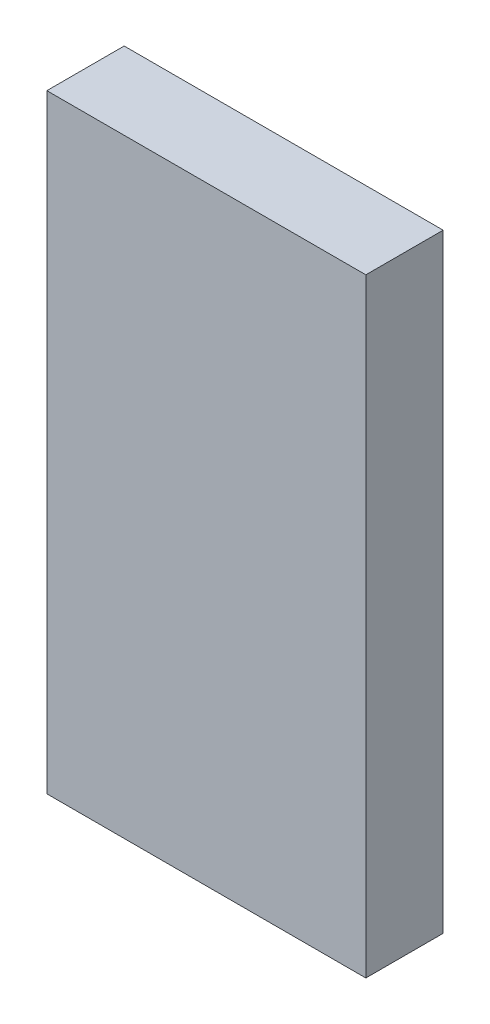
ISO-10303-21;
HEADER;
FILE_DESCRIPTION(('STEP AP214'),'2;1');
FILE_NAME('part.step','',(''),(''),'','','');
FILE_SCHEMA(('AUTOMOTIVE_DESIGN { 1 0 10303 214 1 1 1 1 }'));
ENDSEC;
DATA;
#1=APPLICATION_CONTEXT('core data for automotive mechanical design processes');
#2=APPLICATION_PROTOCOL_DEFINITION('international standard','automotive_design',2000,#1);
#3=PRODUCT_CONTEXT('',#1,'mechanical');
#4=PRODUCT('Part','Part','',(#3));
#5=PRODUCT_RELATED_PRODUCT_CATEGORY('part','',(#4));
#6=PRODUCT_DEFINITION_FORMATION('','',#4);
#7=PRODUCT_DEFINITION_CONTEXT('part definition',#1,'design');
#8=PRODUCT_DEFINITION('design','',#6,#7);
#9=PRODUCT_DEFINITION_SHAPE('','',#8);
#10=(LENGTH_UNIT() NAMED_UNIT(*) SI_UNIT(.MILLI.,.METRE.));
#11=(NAMED_UNIT(*) PLANE_ANGLE_UNIT() SI_UNIT($,.RADIAN.));
#12=(NAMED_UNIT(*) SI_UNIT($,.STERADIAN.) SOLID_ANGLE_UNIT());
#13=UNCERTAINTY_MEASURE_WITH_UNIT(LENGTH_MEASURE(1.E-05),#10,'distance_accuracy_value','');
#14=(GEOMETRIC_REPRESENTATION_CONTEXT(3) GLOBAL_UNCERTAINTY_ASSIGNED_CONTEXT((#13)) GLOBAL_UNIT_ASSIGNED_CONTEXT((#10,
#11,#12)) REPRESENTATION_CONTEXT('',''));
#15=CARTESIAN_POINT('',(0.,0.,0.));
#16=DIRECTION('',(0.,0.,1.));
#17=DIRECTION('',(1.,0.,0.));
#18=AXIS2_PLACEMENT_3D('',#15,#16,#17);
#19=CARTESIAN_POINT('',(17.9471960328776,-13.8940277297927,1.03674100901396E-06));
#20=DIRECTION('',(0.,8.74227339409095E-08,-1.));
#21=DIRECTION('',(1.19248806384999E-08,1.,8.74227339409095E-08));
#22=AXIS2_PLACEMENT_3D('',#19,#20,#21);
#23=PLANE('',#22);
#24=DIRECTION('',(-1.19248807761764E-08,-1.,-8.74227339409095E-08));
#25=VECTOR('',#24,1.);
#26=CARTESIAN_POINT('',(16.2971960328777,-13.8940277101167,1.03674101074869E-06));
#27=LINE('',#26,#25);
#28=CARTESIAN_POINT('',(16.297196070441,-10.7440277101167,1.3121226227937E-06));
#29=VERTEX_POINT('',#28);
#30=CARTESIAN_POINT('',(16.2971959953143,-17.0440277101166,7.61359398703671E-07));
#31=VERTEX_POINT('',#30);
#32=EDGE_CURVE('E90',#29,#31,#27,.T.);
#33=ORIENTED_EDGE('',*,*,#32,.T.);
#34=DIRECTION('',(1.,-1.19248806384999E-08,0.));
#35=VECTOR('',#34,1.);
#36=CARTESIAN_POINT('',(17.9471959953143,-17.0440277297927,7.61359396968947E-07));
#37=LINE('',#36,#35);
#38=CARTESIAN_POINT('',(19.5971959953143,-17.0440277494687,7.61359395234224E-07));
#39=VERTEX_POINT('',#38);
#40=EDGE_CURVE('E27',#31,#39,#37,.T.);
#41=ORIENTED_EDGE('',*,*,#40,.T.);
#42=DIRECTION('',(-1.19248807761764E-08,-1.,-8.74227339409095E-08));
#43=VECTOR('',#42,1.);
#44=CARTESIAN_POINT('',(19.5971960328776,-13.8940277494688,1.03674100727924E-06));
#45=LINE('',#44,#43);
#46=CARTESIAN_POINT('',(19.5971960704411,-10.7440277494688,1.31212261932426E-06));
#47=VERTEX_POINT('',#46);
#48=EDGE_CURVE('E78',#47,#39,#45,.T.);
#49=ORIENTED_EDGE('',*,*,#48,.F.);
#50=DIRECTION('',(1.,-1.19248806384999E-08,0.));
#51=VECTOR('',#50,1.);
#52=CARTESIAN_POINT('',(17.9471960704411,-10.7440277297927,1.31212262105898E-06));
#53=LINE('',#52,#51);
#54=EDGE_CURVE('E101',#29,#47,#53,.T.);
#55=ORIENTED_EDGE('',*,*,#54,.F.);
#56=EDGE_LOOP('',(#33,#41,#49,#55));
#57=FACE_BOUND('',#56,.T.);
#58=ADVANCED_FACE('F17',(#57),#23,.F.);
#59=CARTESIAN_POINT('',(17.9471960328776,-13.8940276598545,-0.799998963258989));
#60=DIRECTION('',(0.,8.74227339409095E-08,-1.));
#61=DIRECTION('',(1.19248806384999E-08,1.,8.74227339409095E-08));
#62=AXIS2_PLACEMENT_3D('',#59,#60,#61);
#63=PLANE('',#62);
#64=DIRECTION('',(-1.19248807761764E-08,-1.,-8.74227339409095E-08));
#65=VECTOR('',#64,1.);
#66=CARTESIAN_POINT('',(16.2971960328777,-13.8940276401785,-0.799998963258987));
#67=LINE('',#66,#65);
#68=CARTESIAN_POINT('',(16.297196070441,-10.7440276401785,-0.799998687877375));
#69=VERTEX_POINT('',#68);
#70=CARTESIAN_POINT('',(16.2971959953143,-17.0440276401785,-0.799999238640599));
#71=VERTEX_POINT('',#70);
#72=EDGE_CURVE('E81',#69,#71,#67,.T.);
#73=ORIENTED_EDGE('',*,*,#72,.F.);
#74=DIRECTION('',(1.,-1.19248806384999E-08,0.));
#75=VECTOR('',#74,1.);
#76=CARTESIAN_POINT('',(17.9471960704411,-10.7440276598545,-0.799998687877377));
#77=LINE('',#76,#75);
#78=CARTESIAN_POINT('',(19.5971960704411,-10.7440276795306,-0.799998687877378));
#79=VERTEX_POINT('',#78);
#80=EDGE_CURVE('E67',#69,#79,#77,.T.);
#81=ORIENTED_EDGE('',*,*,#80,.T.);
#82=DIRECTION('',(-1.19248807761764E-08,-1.,-8.74227339409095E-08));
#83=VECTOR('',#82,1.);
#84=CARTESIAN_POINT('',(19.5971960328776,-13.8940276795306,-0.799998963258991));
#85=LINE('',#84,#83);
#86=CARTESIAN_POINT('',(19.5971959953143,-17.0440276795306,-0.799999238640603));
#87=VERTEX_POINT('',#86);
#88=EDGE_CURVE('E111',#79,#87,#85,.T.);
#89=ORIENTED_EDGE('',*,*,#88,.T.);
#90=DIRECTION('',(1.,-1.19248806384999E-08,0.));
#91=VECTOR('',#90,1.);
#92=CARTESIAN_POINT('',(17.9471959953143,-17.0440276598545,-0.799999238640601));
#93=LINE('',#92,#91);
#94=EDGE_CURVE('E11',#71,#87,#93,.T.);
#95=ORIENTED_EDGE('',*,*,#94,.F.);
#96=EDGE_LOOP('',(#73,#81,#89,#95));
#97=FACE_BOUND('',#96,.T.);
#98=ADVANCED_FACE('F82',(#97),#63,.T.);
#99=CARTESIAN_POINT('',(17.9471959953143,-17.0440276598545,-0.799999238640601));
#100=DIRECTION('',(-1.19248806384999E-08,-1.,-8.74227339409095E-08));
#101=DIRECTION('',(0.,8.74227339409095E-08,-1.));
#102=AXIS2_PLACEMENT_3D('',#99,#100,#101);
#103=PLANE('',#102);
#104=ORIENTED_EDGE('',*,*,#40,.F.);
#105=DIRECTION('',(0.,-8.74227339409095E-08,1.));
#106=VECTOR('',#105,1.);
#107=CARTESIAN_POINT('',(16.2971959953143,-17.0440276401785,-0.799999238640599));
#108=LINE('',#107,#106);
#109=EDGE_CURVE('E86',#71,#31,#108,.T.);
#110=ORIENTED_EDGE('',*,*,#109,.F.);
#111=ORIENTED_EDGE('',*,*,#94,.T.);
#112=DIRECTION('',(0.,-8.74227339409095E-08,1.));
#113=VECTOR('',#112,1.);
#114=CARTESIAN_POINT('',(19.5971959953143,-17.0440276795306,-0.799999238640603));
#115=LINE('',#114,#113);
#116=EDGE_CURVE('E108',#87,#39,#115,.T.);
#117=ORIENTED_EDGE('',*,*,#116,.T.);
#118=EDGE_LOOP('',(#104,#110,#111,#117));
#119=FACE_BOUND('',#118,.T.);
#120=ADVANCED_FACE('F140',(#119),#103,.T.);
#121=CARTESIAN_POINT('',(19.5971960328776,-13.8940276795306,-0.799998963258991));
#122=DIRECTION('',(-1.,1.19248807761763E-08,0.));
#123=DIRECTION('',(1.19248807761764E-08,1.,8.74227339409095E-08));
#124=AXIS2_PLACEMENT_3D('',#121,#122,#123);
#125=PLANE('',#124);
#126=ORIENTED_EDGE('',*,*,#48,.T.);
#127=ORIENTED_EDGE('',*,*,#116,.F.);
#128=ORIENTED_EDGE('',*,*,#88,.F.);
#129=DIRECTION('',(0.,-8.74227339409095E-08,1.));
#130=VECTOR('',#129,1.);
#131=CARTESIAN_POINT('',(19.5971960704411,-10.7440276795306,-0.799998687877378));
#132=LINE('',#131,#130);
#133=EDGE_CURVE('E75',#79,#47,#132,.T.);
#134=ORIENTED_EDGE('',*,*,#133,.T.);
#135=EDGE_LOOP('',(#126,#127,#128,#134));
#136=FACE_BOUND('',#135,.T.);
#137=ADVANCED_FACE('F139',(#136),#125,.F.);
#138=CARTESIAN_POINT('',(17.9471960704411,-10.7440276598545,-0.799998687877377));
#139=DIRECTION('',(-1.19248806384999E-08,-1.,-8.74227339409095E-08));
#140=DIRECTION('',(0.,8.74227339409095E-08,-1.));
#141=AXIS2_PLACEMENT_3D('',#138,#139,#140);
#142=PLANE('',#141);
#143=ORIENTED_EDGE('',*,*,#54,.T.);
#144=ORIENTED_EDGE('',*,*,#133,.F.);
#145=ORIENTED_EDGE('',*,*,#80,.F.);
#146=DIRECTION('',(0.,-8.74227339409095E-08,1.));
#147=VECTOR('',#146,1.);
#148=CARTESIAN_POINT('',(16.297196070441,-10.7440276401785,-0.799998687877375));
#149=LINE('',#148,#147);
#150=EDGE_CURVE('E72',#69,#29,#149,.T.);
#151=ORIENTED_EDGE('',*,*,#150,.T.);
#152=EDGE_LOOP('',(#143,#144,#145,#151));
#153=FACE_BOUND('',#152,.T.);
#154=ADVANCED_FACE('F70',(#153),#142,.F.);
#155=CARTESIAN_POINT('',(16.2971960328777,-13.8940276401785,-0.799998963258987));
#156=DIRECTION('',(-1.,1.19248807761763E-08,0.));
#157=DIRECTION('',(1.19248807761764E-08,1.,8.74227339409095E-08));
#158=AXIS2_PLACEMENT_3D('',#155,#156,#157);
#159=PLANE('',#158);
#160=ORIENTED_EDGE('',*,*,#32,.F.);
#161=ORIENTED_EDGE('',*,*,#150,.F.);
#162=ORIENTED_EDGE('',*,*,#72,.T.);
#163=ORIENTED_EDGE('',*,*,#109,.T.);
#164=EDGE_LOOP('',(#160,#161,#162,#163));
#165=FACE_BOUND('',#164,.T.);
#166=ADVANCED_FACE('F88',(#165),#159,.T.);
#167=CLOSED_SHELL('',(#58,#98,#120,#137,#154,#166));
#168=MANIFOLD_SOLID_BREP('B1',#167);
#169=ADVANCED_BREP_SHAPE_REPRESENTATION('',(#18,#168),#14);
#170=SHAPE_DEFINITION_REPRESENTATION(#9,#169);
ENDSEC;
END-ISO-10303-21;
